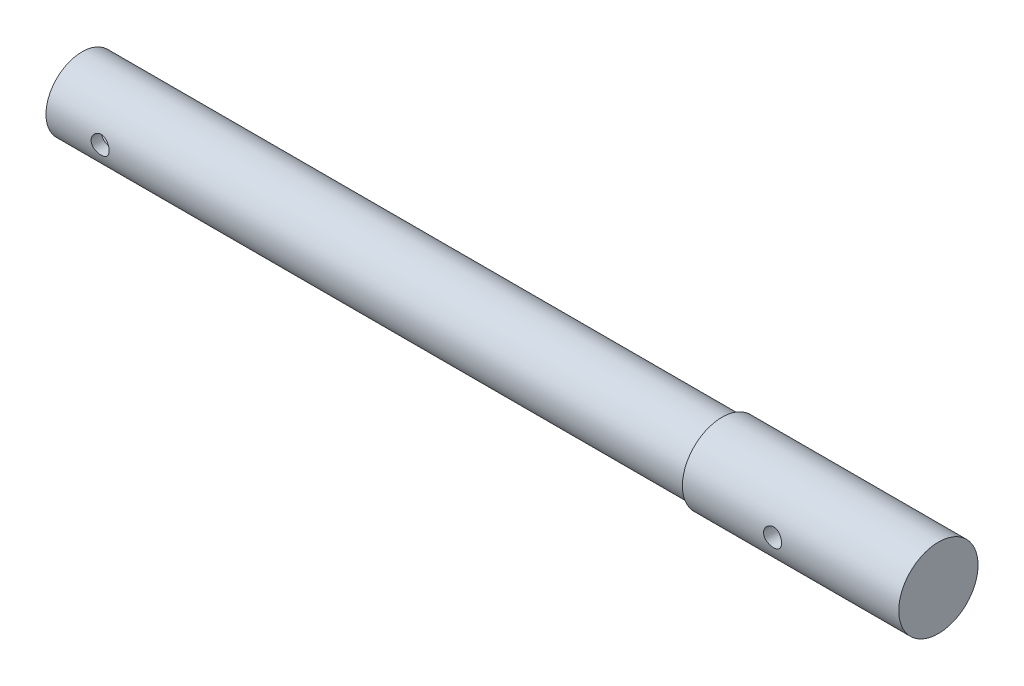
ISO-10303-21;
HEADER;
FILE_DESCRIPTION(('STEP AP214'),'2;1');
FILE_NAME('part.step','',(''),(''),'','','');
FILE_SCHEMA(('AUTOMOTIVE_DESIGN { 1 0 10303 214 1 1 1 1 }'));
ENDSEC;
DATA;
#1=APPLICATION_CONTEXT('core data for automotive mechanical design processes');
#2=APPLICATION_PROTOCOL_DEFINITION('international standard','automotive_design',2000,#1);
#3=PRODUCT_CONTEXT('',#1,'mechanical');
#4=PRODUCT('Part','Part','',(#3));
#5=PRODUCT_RELATED_PRODUCT_CATEGORY('part','',(#4));
#6=PRODUCT_DEFINITION_FORMATION('','',#4);
#7=PRODUCT_DEFINITION_CONTEXT('part definition',#1,'design');
#8=PRODUCT_DEFINITION('design','',#6,#7);
#9=PRODUCT_DEFINITION_SHAPE('','',#8);
#10=(LENGTH_UNIT() NAMED_UNIT(*) SI_UNIT(.MILLI.,.METRE.));
#11=(NAMED_UNIT(*) PLANE_ANGLE_UNIT() SI_UNIT($,.RADIAN.));
#12=(NAMED_UNIT(*) SI_UNIT($,.STERADIAN.) SOLID_ANGLE_UNIT());
#13=UNCERTAINTY_MEASURE_WITH_UNIT(LENGTH_MEASURE(1.E-05),#10,'distance_accuracy_value','');
#14=(GEOMETRIC_REPRESENTATION_CONTEXT(3) GLOBAL_UNCERTAINTY_ASSIGNED_CONTEXT((#13)) GLOBAL_UNIT_ASSIGNED_CONTEXT((#10,
#11,#12)) REPRESENTATION_CONTEXT('',''));
#15=CARTESIAN_POINT('',(0.,0.,0.));
#16=DIRECTION('',(0.,0.,1.));
#17=DIRECTION('',(1.,0.,0.));
#18=AXIS2_PLACEMENT_3D('',#15,#16,#17);
#19=CARTESIAN_POINT('',(0.,0.,0.));
#20=DIRECTION('',(-1.,0.,0.));
#21=DIRECTION('',(0.,0.,1.));
#22=AXIS2_PLACEMENT_3D('',#19,#20,#21);
#23=PLANE('',#22);
#24=CARTESIAN_POINT('',(0.,0.,0.));
#25=DIRECTION('',(-1.,0.,0.));
#26=DIRECTION('',(0.,0.,1.));
#27=AXIS2_PLACEMENT_3D('',#24,#25,#26);
#28=CIRCLE('',#27,11.);
#29=CARTESIAN_POINT('',(0.,0.,11.));
#30=VERTEX_POINT('',#29);
#31=EDGE_CURVE('E50',#30,#30,#28,.T.);
#32=ORIENTED_EDGE('',*,*,#31,.F.);
#33=EDGE_LOOP('',(#32));
#34=FACE_BOUND('',#33,.T.);
#35=ADVANCED_FACE('F34',(#34),#23,.F.);
#36=CARTESIAN_POINT('',(-237.5,0.,0.));
#37=DIRECTION('',(-1.,0.,0.));
#38=DIRECTION('',(0.,0.,1.));
#39=AXIS2_PLACEMENT_3D('',#36,#37,#38);
#40=CYLINDRICAL_SURFACE('',#39,11.);
#41=CARTESIAN_POINT('',(-32.5,0.,-11.));
#42=CARTESIAN_POINT('',(-32.5000045318264,0.138518278596931,-10.9999974735185));
#43=CARTESIAN_POINT('',(-32.5115512275769,0.277090172258033,-10.9973570934613));
#44=CARTESIAN_POINT('',(-32.5573794760617,0.550288594599343,-10.987079320306));
#45=CARTESIAN_POINT('',(-32.5916763959553,0.684912392220746,-10.9794385496265));
#46=CARTESIAN_POINT('',(-32.6818680486319,0.94622767198493,-10.9600095312294));
#47=CARTESIAN_POINT('',(-32.7377393279807,1.07292759495649,-10.9482257885674));
#48=CARTESIAN_POINT('',(-32.8694171133808,1.31515227582567,-10.921778201627));
#49=CARTESIAN_POINT('',(-32.9452234208424,1.43067714503183,-10.9071143860399));
#50=CARTESIAN_POINT('',(-33.1160020446066,1.64926760444639,-10.8762265816814));
#51=CARTESIAN_POINT('',(-33.211252573475,1.7521129389205,-10.8599819758326));
#52=CARTESIAN_POINT('',(-33.4176189741372,1.94051389816611,-10.827906511833));
#53=CARTESIAN_POINT('',(-33.5287363506944,2.02606788121784,-10.8120756930933));
#54=CARTESIAN_POINT('',(-33.7653320552837,2.17844599401787,-10.7824158369221));
#55=CARTESIAN_POINT('',(-33.8909669963058,2.24503254356577,-10.7686131580577));
#56=CARTESIAN_POINT('',(-34.1520095005816,2.35606069717871,-10.7448696147508));
#57=CARTESIAN_POINT('',(-34.2874157920616,2.40050517717749,-10.7349282488168));
#58=CARTESIAN_POINT('',(-34.5617591871165,2.46525349412718,-10.7202434469831));
#59=CARTESIAN_POINT('',(-34.7005992631225,2.48594892680755,-10.715415797339));
#60=CARTESIAN_POINT('',(-34.9798582272131,2.50382988451489,-10.7112523406768));
#61=CARTESIAN_POINT('',(-35.1202769026623,2.50101853886554,-10.711915802658));
#62=CARTESIAN_POINT('',(-35.3957728833487,2.47228016958763,-10.7185835035919));
#63=CARTESIAN_POINT('',(-35.5309009061949,2.44681104599439,-10.7244819412976));
#64=CARTESIAN_POINT('',(-35.7949144861548,2.37420684920503,-10.7407873672743));
#65=CARTESIAN_POINT('',(-35.9237996676272,2.32707047404289,-10.7511946264744));
#66=CARTESIAN_POINT('',(-36.1729406718105,2.21205734402545,-10.7754474384537));
#67=CARTESIAN_POINT('',(-36.2931135177637,2.14400712086008,-10.7893215597825));
#68=CARTESIAN_POINT('',(-36.5205025531111,1.98921977920408,-10.8189276843241));
#69=CARTESIAN_POINT('',(-36.6277168402639,1.90247992237134,-10.8346599596346));
#70=CARTESIAN_POINT('',(-36.828778561821,1.71036518003516,-10.866661528725));
#71=CARTESIAN_POINT('',(-36.9222544265163,1.60460166742827,-10.882934773515));
#72=CARTESIAN_POINT('',(-37.0902058887071,1.37871229840972,-10.9138502597158));
#73=CARTESIAN_POINT('',(-37.1646810866995,1.2585861400908,-10.9284924668293));
#74=CARTESIAN_POINT('',(-37.2926203879715,1.00690799179916,-10.9545497424637));
#75=CARTESIAN_POINT('',(-37.3460327736223,0.875328834348156,-10.9659568484873));
#76=CARTESIAN_POINT('',(-37.4298840058679,0.604745122491696,-10.9841998956698));
#77=CARTESIAN_POINT('',(-37.4603264658222,0.465741739663721,-10.9910365557784));
#78=CARTESIAN_POINT('',(-37.4968262374727,0.187439840192737,-10.9992650071756));
#79=CARTESIAN_POINT('',(-37.5033906913167,0.0482110923370425,-11.0007700184113));
#80=CARTESIAN_POINT('',(-37.4933269601471,-0.2293538866801,-10.9984842255063));
#81=CARTESIAN_POINT('',(-37.476700480594,-0.367690182720856,-10.9946938107912));
#82=CARTESIAN_POINT('',(-37.4211468330946,-0.637841677218453,-10.9823148103741));
#83=CARTESIAN_POINT('',(-37.3824884535563,-0.769715036814416,-10.973784087055));
#84=CARTESIAN_POINT('',(-37.2842689725429,-1.02510393087759,-10.9528806132367));
#85=CARTESIAN_POINT('',(-37.2247059957467,-1.14861871432288,-10.9405075180554));
#86=CARTESIAN_POINT('',(-37.0853308564446,-1.38586085256055,-10.9130143275095));
#87=CARTESIAN_POINT('',(-37.0052243732268,-1.49941068522718,-10.8978552985532));
#88=CARTESIAN_POINT('',(-36.8274206715598,-1.71163773579051,-10.866546095646));
#89=CARTESIAN_POINT('',(-36.7297209734532,-1.8103128535797,-10.8503957821912));
#90=CARTESIAN_POINT('',(-36.5171690348666,-1.99201706218096,-10.8185287714487));
#91=CARTESIAN_POINT('',(-36.4020127582132,-2.0746936659406,-10.8028272119253));
#92=CARTESIAN_POINT('',(-36.1591536093297,-2.21953814406551,-10.7740023321604));
#93=CARTESIAN_POINT('',(-36.0314512920404,-2.28170692501017,-10.7608788979592));
#94=CARTESIAN_POINT('',(-35.7678195304311,-2.38333597241928,-10.7388274870674));
#95=CARTESIAN_POINT('',(-35.6319426762566,-2.42292716221703,-10.7298753781702));
#96=CARTESIAN_POINT('',(-35.3552330933009,-2.47865258340363,-10.7171411058581));
#97=CARTESIAN_POINT('',(-35.2144012348636,-2.49479091341614,-10.7133580391079));
#98=CARTESIAN_POINT('',(-34.9353413806891,-2.50296739214164,-10.7114502943222));
#99=CARTESIAN_POINT('',(-34.7971304006664,-2.49556548501069,-10.7131941458177));
#100=CARTESIAN_POINT('',(-34.5239810898117,-2.45813115403282,-10.7218446846914));
#101=CARTESIAN_POINT('',(-34.3890427138895,-2.42809904217009,-10.7287513008948));
#102=CARTESIAN_POINT('',(-34.1267566026337,-2.34653692360609,-10.7468826027048));
#103=CARTESIAN_POINT('',(-33.9993803088585,-2.29509457527994,-10.758089666867));
#104=CARTESIAN_POINT('',(-33.7549852930994,-2.17224536606879,-10.783564723281));
#105=CARTESIAN_POINT('',(-33.6379677496745,-2.10083623731222,-10.7978330631966));
#106=CARTESIAN_POINT('',(-33.4148655723447,-1.93824996891049,-10.828211072634));
#107=CARTESIAN_POINT('',(-33.3090742777926,-1.84667645642834,-10.8443540558786));
#108=CARTESIAN_POINT('',(-33.114176814918,-1.64715628932417,-10.8764454859305));
#109=CARTESIAN_POINT('',(-33.025074529034,-1.53920583540676,-10.8923938866665));
#110=CARTESIAN_POINT('',(-32.8648619397663,-1.30814060515057,-10.9225693389041));
#111=CARTESIAN_POINT('',(-32.7940261766668,-1.18483162187621,-10.9367686161711));
#112=CARTESIAN_POINT('',(-32.674200029337,-0.927755967711694,-10.9615640551399));
#113=CARTESIAN_POINT('',(-32.6251920052134,-0.793997844337688,-10.9721631246672));
#114=CARTESIAN_POINT('',(-32.5587720938239,-0.550163071539607,-10.9867559512784));
#115=CARTESIAN_POINT('',(-32.5367760123107,-0.441368111138475,-10.9916908558499));
#116=CARTESIAN_POINT('',(-32.5073885264206,-0.221726814930898,-10.9983138080737));
#117=CARTESIAN_POINT('',(-32.4999963723808,-0.110880584717078,-11.0000020223883));
#118=CARTESIAN_POINT('',(-32.5,0.,-11.));
#119=B_SPLINE_CURVE_WITH_KNOTS('',3,(#41,#42,#43,#44,#45,#46,#47,#48,#49,#50,#51,#52,#53,#54,
#55,#56,#57,#58,#59,#60,#61,#62,#63,#64,#65,#66,#67,#68,#69,#70,#71,#72,#73,#74,#75,#76,#77,#78,
#79,#80,#81,#82,#83,#84,#85,#86,#87,#88,#89,#90,#91,#92,#93,#94,#95,#96,#97,#98,#99,#100,#101,
#102,#103,#104,#105,#106,#107,#108,#109,#110,#111,#112,#113,#114,#115,#116,#117,#118),
.UNSPECIFIED.,.T.,.F.,(4,2,2,2,2,2,2,2,2,2,2,2,2,2,2,2,2,2,2,2,2,2,2,2,2,2,2,2,2,2,2,2,2,2,2,2,
2,2,4),(0.,0.415148849633309,0.830578406996924,1.24555761755317,1.66053269430522,
2.08192389396806,2.50335508365801,2.92985362973412,3.35629676538236,3.77560244898081,
4.19485231368759,4.60581714174236,5.01680666753972,5.4313015743885,5.84585725297977,
6.27011531803704,6.69438230269863,7.11968464096648,7.54492006169895,7.96106941916762,
8.37718817463626,8.78833576149035,9.19952024123084,9.61696129328767,10.0344612272567,
10.4603132154039,10.8861463755948,11.3094844190899,11.732748471094,12.1460204395145,
12.5592867105954,12.9708773657615,13.382514789318,13.8031102578591,14.2238034502007,
14.6504927745346,15.0768366452215,15.4091704772436,15.74148724914),.UNSPECIFIED.);
#120=CARTESIAN_POINT('',(-32.5,0.,-11.));
#121=VERTEX_POINT('',#120);
#122=EDGE_CURVE('E10',#121,#121,#119,.T.);
#123=ORIENTED_EDGE('',*,*,#122,.T.);
#124=EDGE_LOOP('',(#123));
#125=FACE_BOUND('',#124,.T.);
#126=CARTESIAN_POINT('',(-32.5,0.,11.));
#127=CARTESIAN_POINT('',(-32.5000045318264,-0.138518278596891,10.9999974735185));
#128=CARTESIAN_POINT('',(-32.5115512275769,-0.277090172257995,10.9973570934613));
#129=CARTESIAN_POINT('',(-32.5573794760617,-0.55028859459931,10.987079320306));
#130=CARTESIAN_POINT('',(-32.5916763959553,-0.684912392220716,10.9794385496265));
#131=CARTESIAN_POINT('',(-32.6818680486319,-0.946227671984906,10.9600095312294));
#132=CARTESIAN_POINT('',(-32.7377393279807,-1.07292759495647,10.9482257885674));
#133=CARTESIAN_POINT('',(-32.8694171133808,-1.31515227582566,10.921778201627));
#134=CARTESIAN_POINT('',(-32.9452234208424,-1.43067714503183,10.9071143860399));
#135=CARTESIAN_POINT('',(-33.1160020446066,-1.64926760444638,10.8762265816814));
#136=CARTESIAN_POINT('',(-33.211252573475,-1.75211293892048,10.8599819758326));
#137=CARTESIAN_POINT('',(-33.4176189741372,-1.94051389816609,10.827906511833));
#138=CARTESIAN_POINT('',(-33.5287363506944,-2.02606788121783,10.8120756930933));
#139=CARTESIAN_POINT('',(-33.7653320552837,-2.17844599401786,10.7824158369221));
#140=CARTESIAN_POINT('',(-33.8909669963058,-2.24503254356574,10.7686131580577));
#141=CARTESIAN_POINT('',(-34.1520095005816,-2.35606069717869,10.7448696147509));
#142=CARTESIAN_POINT('',(-34.2874157920616,-2.40050517717749,10.7349282488168));
#143=CARTESIAN_POINT('',(-34.5617591871165,-2.46525349412718,10.7202434469831));
#144=CARTESIAN_POINT('',(-34.7005992631225,-2.48594892680753,10.715415797339));
#145=CARTESIAN_POINT('',(-34.9798582272131,-2.50382988451486,10.7112523406768));
#146=CARTESIAN_POINT('',(-35.1202769026623,-2.50101853886553,10.711915802658));
#147=CARTESIAN_POINT('',(-35.3957728833487,-2.47228016958762,10.7185835035919));
#148=CARTESIAN_POINT('',(-35.5309009061949,-2.44681104599436,10.7244819412976));
#149=CARTESIAN_POINT('',(-35.7949144861548,-2.374206849205,10.7407873672743));
#150=CARTESIAN_POINT('',(-35.9237996676272,-2.32707047404288,10.7511946264744));
#151=CARTESIAN_POINT('',(-36.1729406718105,-2.21205734402543,10.7754474384537));
#152=CARTESIAN_POINT('',(-36.2931135177637,-2.14400712086006,10.7893215597825));
#153=CARTESIAN_POINT('',(-36.520502553111,-1.98921977920407,10.8189276843241));
#154=CARTESIAN_POINT('',(-36.6277168402639,-1.90247992237134,10.8346599596346));
#155=CARTESIAN_POINT('',(-36.828778561821,-1.71036518003517,10.8666615287251));
#156=CARTESIAN_POINT('',(-36.9222544265163,-1.60460166742826,10.882934773515));
#157=CARTESIAN_POINT('',(-37.0902058887071,-1.37871229840971,10.9138502597158));
#158=CARTESIAN_POINT('',(-37.1646810866995,-1.2585861400908,10.9284924668293));
#159=CARTESIAN_POINT('',(-37.2926203879715,-1.00690799179915,10.9545497424638));
#160=CARTESIAN_POINT('',(-37.3460327736223,-0.87532883434815,10.9659568484874));
#161=CARTESIAN_POINT('',(-37.4298840058679,-0.604745122491694,10.9841998956698));
#162=CARTESIAN_POINT('',(-37.4603264658222,-0.465741739663724,10.9910365557784));
#163=CARTESIAN_POINT('',(-37.4968262374727,-0.187439840192742,10.9992650071756));
#164=CARTESIAN_POINT('',(-37.5033906913167,-0.0482110923370446,11.0007700184113));
#165=CARTESIAN_POINT('',(-37.4933269601471,0.229353886680103,10.9984842255063));
#166=CARTESIAN_POINT('',(-37.476700480594,0.36769018272086,10.9946938107912));
#167=CARTESIAN_POINT('',(-37.4211468330946,0.637841677218461,10.9823148103741));
#168=CARTESIAN_POINT('',(-37.3824884535563,0.769715036814426,10.973784087055));
#169=CARTESIAN_POINT('',(-37.2842689725429,1.0251039308776,10.9528806132367));
#170=CARTESIAN_POINT('',(-37.2247059957467,1.14861871432289,10.9405075180554));
#171=CARTESIAN_POINT('',(-37.0853308564446,1.38586085256056,10.9130143275095));
#172=CARTESIAN_POINT('',(-37.0052243732268,1.49941068522719,10.8978552985532));
#173=CARTESIAN_POINT('',(-36.8274206715598,1.71163773579053,10.866546095646));
#174=CARTESIAN_POINT('',(-36.7297209734532,1.81031285357971,10.8503957821913));
#175=CARTESIAN_POINT('',(-36.5171690348666,1.99201706218097,10.8185287714487));
#176=CARTESIAN_POINT('',(-36.4020127582132,2.07469366594063,10.8028272119253));
#177=CARTESIAN_POINT('',(-36.1591536093297,2.21953814406552,10.7740023321604));
#178=CARTESIAN_POINT('',(-36.0314512920404,2.28170692501017,10.7608788979592));
#179=CARTESIAN_POINT('',(-35.7678195304311,2.38333597241928,10.7388274870674));
#180=CARTESIAN_POINT('',(-35.6319426762566,2.42292716221705,10.7298753781702));
#181=CARTESIAN_POINT('',(-35.3552330933009,2.47865258340366,10.7171411058581));
#182=CARTESIAN_POINT('',(-35.2144012348636,2.49479091341614,10.7133580391079));
#183=CARTESIAN_POINT('',(-34.9353413806891,2.50296739214165,10.7114502943222));
#184=CARTESIAN_POINT('',(-34.7971304006664,2.49556548501072,10.7131941458177));
#185=CARTESIAN_POINT('',(-34.5239810898117,2.45813115403284,10.7218446846914));
#186=CARTESIAN_POINT('',(-34.3890427138895,2.42809904217009,10.7287513008948));
#187=CARTESIAN_POINT('',(-34.1267566026337,2.34653692360609,10.7468826027048));
#188=CARTESIAN_POINT('',(-33.9993803088585,2.29509457527996,10.758089666867));
#189=CARTESIAN_POINT('',(-33.7549852930994,2.17224536606882,10.7835647232811));
#190=CARTESIAN_POINT('',(-33.6379677496745,2.10083623731225,10.7978330631966));
#191=CARTESIAN_POINT('',(-33.4148655723447,1.93824996891051,10.8282110726341));
#192=CARTESIAN_POINT('',(-33.3090742777926,1.84667645642836,10.8443540558786));
#193=CARTESIAN_POINT('',(-33.114176814918,1.64715628932419,10.8764454859305));
#194=CARTESIAN_POINT('',(-33.025074529034,1.53920583540677,10.8923938866665));
#195=CARTESIAN_POINT('',(-32.8648619397663,1.30814060515058,10.9225693389041));
#196=CARTESIAN_POINT('',(-32.7940261766668,1.18483162187622,10.9367686161711));
#197=CARTESIAN_POINT('',(-32.674200029337,0.927755967711713,10.9615640551399));
#198=CARTESIAN_POINT('',(-32.6251920052133,0.793997844337707,10.9721631246672));
#199=CARTESIAN_POINT('',(-32.5587720938239,0.550163071539631,10.9867559512784));
#200=CARTESIAN_POINT('',(-32.5367760123107,0.441368111138502,10.9916908558499));
#201=CARTESIAN_POINT('',(-32.5073885264206,0.221726814930933,10.9983138080738));
#202=CARTESIAN_POINT('',(-32.4999963723808,0.110880584717116,11.0000020223883));
#203=CARTESIAN_POINT('',(-32.5,0.,11.));
#204=B_SPLINE_CURVE_WITH_KNOTS('',3,(#126,#127,#128,#129,#130,#131,#132,#133,#134,#135,#136,
#137,#138,#139,#140,#141,#142,#143,#144,#145,#146,#147,#148,#149,#150,#151,#152,#153,#154,#155,
#156,#157,#158,#159,#160,#161,#162,#163,#164,#165,#166,#167,#168,#169,#170,#171,#172,#173,#174,
#175,#176,#177,#178,#179,#180,#181,#182,#183,#184,#185,#186,#187,#188,#189,#190,#191,#192,#193,
#194,#195,#196,#197,#198,#199,#200,#201,#202,#203),.UNSPECIFIED.,.T.,.F.,(4,2,2,2,2,2,2,2,2,2,2,
2,2,2,2,2,2,2,2,2,2,2,2,2,2,2,2,2,2,2,2,2,2,2,2,2,2,2,4),(0.,0.415148849633315,
0.830578406996938,1.2455576175532,1.66053269430526,2.08192389396809,2.50335508365803,
2.92985362973415,3.35629676538239,3.77560244898084,4.19485231368761,4.60581714174238,
5.01680666753974,5.43130157438851,5.84585725297978,6.27011531803705,6.69438230269865,
7.11968464096648,7.54492006169895,7.96106941916762,8.37718817463628,8.78833576149037,
9.19952024123085,9.61696129328768,10.0344612272567,10.460313215404,10.8861463755948,
11.3094844190899,11.732748471094,12.1460204395145,12.5592867105954,12.9708773657615,
13.382514789318,13.8031102578591,14.2238034502007,14.6504927745347,15.0768366452216,
15.4091704772436,15.74148724914),.UNSPECIFIED.);
#205=CARTESIAN_POINT('',(-32.5,0.,11.));
#206=VERTEX_POINT('',#205);
#207=EDGE_CURVE('E45',#206,#206,#204,.T.);
#208=ORIENTED_EDGE('',*,*,#207,.T.);
#209=EDGE_LOOP('',(#208));
#210=FACE_BOUND('',#209,.T.);
#211=CARTESIAN_POINT('',(-60.,0.,0.));
#212=DIRECTION('',(-1.,0.,0.));
#213=DIRECTION('',(0.,0.,1.));
#214=AXIS2_PLACEMENT_3D('',#211,#212,#213);
#215=CIRCLE('',#214,11.);
#216=CARTESIAN_POINT('',(-60.,0.,11.));
#217=VERTEX_POINT('',#216);
#218=EDGE_CURVE('E122',#217,#217,#215,.T.);
#219=ORIENTED_EDGE('',*,*,#218,.F.);
#220=EDGE_LOOP('',(#219));
#221=FACE_BOUND('',#220,.T.);
#222=ORIENTED_EDGE('',*,*,#31,.T.);
#223=EDGE_LOOP('',(#222));
#224=FACE_BOUND('',#223,.T.);
#225=ADVANCED_FACE('F61',(#125,#210,#221,#224),#40,.T.);
#226=CARTESIAN_POINT('',(-60.,11.,0.));
#227=DIRECTION('',(1.,0.,0.));
#228=DIRECTION('',(0.,0.,-1.));
#229=AXIS2_PLACEMENT_3D('',#226,#227,#228);
#230=PLANE('',#229);
#231=CARTESIAN_POINT('',(-60.,0.,0.));
#232=DIRECTION('',(-1.,0.,0.));
#233=DIRECTION('',(0.,0.,1.));
#234=AXIS2_PLACEMENT_3D('',#231,#232,#233);
#235=CIRCLE('',#234,10.);
#236=CARTESIAN_POINT('',(-60.,0.,10.));
#237=VERTEX_POINT('',#236);
#238=EDGE_CURVE('E124',#237,#237,#235,.T.);
#239=ORIENTED_EDGE('',*,*,#238,.F.);
#240=EDGE_LOOP('',(#239));
#241=FACE_BOUND('',#240,.T.);
#242=ORIENTED_EDGE('',*,*,#218,.T.);
#243=EDGE_LOOP('',(#242));
#244=FACE_BOUND('',#243,.T.);
#245=ADVANCED_FACE('F80',(#241,#244),#230,.F.);
#246=CARTESIAN_POINT('',(-237.5,0.,0.));
#247=DIRECTION('',(-1.,0.,0.));
#248=DIRECTION('',(0.,0.,1.));
#249=AXIS2_PLACEMENT_3D('',#246,#247,#248);
#250=CYLINDRICAL_SURFACE('',#249,9.99999999999999);
#251=CARTESIAN_POINT('',(-220.,0.,9.99999999999999));
#252=CARTESIAN_POINT('',(-220.00000387623,-0.138126814449563,9.99999766446686));
#253=CARTESIAN_POINT('',(-220.011485917956,-0.276296929717958,9.99710963553044));
#254=CARTESIAN_POINT('',(-220.057041918845,-0.548677206284231,9.98586856383157));
#255=CARTESIAN_POINT('',(-220.091128682563,-0.682885078117891,9.97751242366625));
#256=CARTESIAN_POINT('',(-220.180732089103,-0.94336812030431,9.95626043886718));
#257=CARTESIAN_POINT('',(-220.236222997859,-1.06965260571673,9.94337004736762));
#258=CARTESIAN_POINT('',(-220.366968983408,-1.31112021984076,9.91442239679368));
#259=CARTESIAN_POINT('',(-220.442224726865,-1.4263029739146,9.8983650309026));
#260=CARTESIAN_POINT('',(-220.61200131609,-1.64466987883487,9.86445689319488));
#261=CARTESIAN_POINT('',(-220.706852624932,-1.74759281676851,9.84657845246875));
#262=CARTESIAN_POINT('',(-220.912420341515,-1.93624821200563,9.81122700196558));
#263=CARTESIAN_POINT('',(-221.023138538245,-2.02197872824868,9.79375403816444));
#264=CARTESIAN_POINT('',(-221.259325377895,-2.17504423799829,9.7609129283028));
#265=CARTESIAN_POINT('',(-221.384988718014,-2.24208702654194,9.74557990774683));
#266=CARTESIAN_POINT('',(-221.646247352767,-2.35399484758463,9.71915824696692));
#267=CARTESIAN_POINT('',(-221.781841055553,-2.3988634257336,9.70806892824029));
#268=CARTESIAN_POINT('',(-222.056239163669,-2.46425806134129,9.69167461160537));
#269=CARTESIAN_POINT('',(-222.19492482673,-2.48525378055344,9.68625818328351));
#270=CARTESIAN_POINT('',(-222.473947614999,-2.50376962511071,9.68148937432651));
#271=CARTESIAN_POINT('',(-222.61428446782,-2.50129356969689,9.68213600713212));
#272=CARTESIAN_POINT('',(-222.889026346242,-2.47331087439951,9.68932009194694));
#273=CARTESIAN_POINT('',(-223.023492702442,-2.44836390031768,9.69571438345489));
#274=CARTESIAN_POINT('',(-223.286268418185,-2.37704031150496,9.71344516118448));
#275=CARTESIAN_POINT('',(-223.414577338381,-2.33066217011568,9.7247819994873));
#276=CARTESIAN_POINT('',(-223.662896693753,-2.21731579656198,9.75125189842764));
#277=CARTESIAN_POINT('',(-223.782810286316,-2.15014444538813,9.76642212449694));
#278=CARTESIAN_POINT('',(-224.009864516261,-1.99726046002484,9.79882851409986));
#279=CARTESIAN_POINT('',(-224.117002913445,-1.91154458134807,9.81606503891047));
#280=CARTESIAN_POINT('',(-224.318672692824,-1.72110570780205,9.85126467566485));
#281=CARTESIAN_POINT('',(-224.412757483435,-1.61591043027637,9.86923449130002));
#282=CARTESIAN_POINT('',(-224.582035404106,-1.39101986250609,9.90343275964594));
#283=CARTESIAN_POINT('',(-224.657227957106,-1.27132412951323,9.91966115915679));
#284=CARTESIAN_POINT('',(-224.786750977041,-1.02019314780232,9.9486288682365));
#285=CARTESIAN_POINT('',(-224.841008900424,-0.888718988680973,9.96135600212879));
#286=CARTESIAN_POINT('',(-224.926528842849,-0.618126680238056,9.98179861652361));
#287=CARTESIAN_POINT('',(-224.957795260697,-0.479009998584106,9.98951505565468));
#288=CARTESIAN_POINT('',(-224.995762609265,-0.200899950650047,9.99892498785624));
#289=CARTESIAN_POINT('',(-225.003071710125,-0.0619945333136788,10.0007675584713));
#290=CARTESIAN_POINT('',(-224.994584996574,0.21505479133586,9.99864674690753));
#291=CARTESIAN_POINT('',(-224.978791262001,0.353198766074341,9.9946838873642));
#292=CARTESIAN_POINT('',(-224.925048486014,0.622690447960814,9.98149301878917));
#293=CARTESIAN_POINT('',(-224.887431227538,0.754108531614561,9.97234390309647));
#294=CARTESIAN_POINT('',(-224.791488193286,1.00876215408751,9.94981177723595));
#295=CARTESIAN_POINT('',(-224.733160326144,1.13199686505443,9.93642833949964));
#296=CARTESIAN_POINT('',(-224.596273118542,1.36920522404974,9.90655513210369));
#297=CARTESIAN_POINT('',(-224.517373146005,1.48297573639294,9.89001445610999));
#298=CARTESIAN_POINT('',(-224.342016818671,1.69587768940551,9.85574181979587));
#299=CARTESIAN_POINT('',(-224.24555743397,1.79500659828876,9.83800965421577));
#300=CARTESIAN_POINT('',(-224.034996731927,1.97831761345416,9.80281594932497));
#301=CARTESIAN_POINT('',(-223.920520495001,2.06207311270184,9.78537173637464));
#302=CARTESIAN_POINT('',(-223.678778942552,2.20918459835604,9.75321463970069));
#303=CARTESIAN_POINT('',(-223.551514195049,2.27254149026903,9.7385016347494));
#304=CARTESIAN_POINT('',(-223.288490462656,2.37658570101226,9.71363491194664));
#305=CARTESIAN_POINT('',(-223.152787286146,2.41740732773932,9.70345425375809));
#306=CARTESIAN_POINT('',(-222.876150603574,2.47557609990489,9.68877906706586));
#307=CARTESIAN_POINT('',(-222.735218248298,2.49292837912653,9.68428329504043));
#308=CARTESIAN_POINT('',(-222.456464960231,2.50339765056087,9.6815816870161));
#309=CARTESIAN_POINT('',(-222.318670941456,2.49719649630137,9.68319887888033));
#310=CARTESIAN_POINT('',(-222.046160185556,2.4622954638537,9.69213181672142));
#311=CARTESIAN_POINT('',(-221.911443386644,2.43359603781101,9.6994474481773));
#312=CARTESIAN_POINT('',(-221.649652568223,2.35488553240497,9.7188543447322));
#313=CARTESIAN_POINT('',(-221.522537824599,2.30500234113408,9.73091692061056));
#314=CARTESIAN_POINT('',(-221.27839102881,2.18544152267507,9.75846259540839));
#315=CARTESIAN_POINT('',(-221.161360378022,2.11576115005697,9.77394616867807));
#316=CARTESIAN_POINT('',(-220.937408951663,1.9564462477286,9.80709390439337));
#317=CARTESIAN_POINT('',(-220.830831544293,1.86633860485383,9.82480441386301));
#318=CARTESIAN_POINT('',(-220.634088258674,1.66964895198295,9.86013378743768));
#319=CARTESIAN_POINT('',(-220.543926283145,1.56306303543526,9.8777526287842));
#320=CARTESIAN_POINT('',(-220.380981152392,1.33411264450434,9.91129426079448));
#321=CARTESIAN_POINT('',(-220.308542310547,1.21149737052739,9.92718055609782));
#322=CARTESIAN_POINT('',(-220.185420895099,0.955443432517535,9.9550820829186));
#323=CARTESIAN_POINT('',(-220.134722732252,0.822012605727921,9.967100086663));
#324=CARTESIAN_POINT('',(-220.06404694945,0.574017088739122,9.98413432609235));
#325=CARTESIAN_POINT('',(-220.040081261577,0.460633618180135,9.99004308421151));
#326=CARTESIAN_POINT('',(-220.00805676063,0.231510119227165,9.9979767538658));
#327=CARTESIAN_POINT('',(-219.999996751158,0.115770268737706,10.0000019575149));
#328=CARTESIAN_POINT('',(-220.,0.,9.99999999999999));
#329=B_SPLINE_CURVE_WITH_KNOTS('',3,(#251,#252,#253,#254,#255,#256,#257,#258,#259,#260,#261,
#262,#263,#264,#265,#266,#267,#268,#269,#270,#271,#272,#273,#274,#275,#276,#277,#278,#279,#280,
#281,#282,#283,#284,#285,#286,#287,#288,#289,#290,#291,#292,#293,#294,#295,#296,#297,#298,#299,
#300,#301,#302,#303,#304,#305,#306,#307,#308,#309,#310,#311,#312,#313,#314,#315,#316,#317,#318,
#319,#320,#321,#322,#323,#324,#325,#326,#327,#328),.UNSPECIFIED.,.T.,.F.,(4,2,2,2,2,2,2,2,2,2,2,
2,2,2,2,2,2,2,2,2,2,2,2,2,2,2,2,2,2,2,2,2,2,2,2,2,2,2,4),(0.,0.413956187453158,
0.828147062939855,1.24184150381021,1.65554990028229,2.07690725728573,2.49831215966778,
2.92597745909684,3.35357435282285,3.77260491835128,4.19156730193381,4.60037495017246,
5.00921172448945,5.42217546462014,5.83521151399152,6.26002501620577,6.68485149269294,
7.11113715020737,7.53734122819951,7.95263848254338,8.36789835193448,8.77700457528938,
9.18615212209362,9.60255979281132,10.0190393835224,10.44574182013,10.8724253125472,
11.2965375769764,11.7205570543047,12.1323963400749,12.5442273493654,12.9536066760889,
13.3630428023798,13.7831596069299,14.2033761629384,14.6312030917579,15.0587227304539,
15.4057040491339,15.7526592674821),.UNSPECIFIED.);
#330=CARTESIAN_POINT('',(-220.,0.,9.99999999999999));
#331=VERTEX_POINT('',#330);
#332=EDGE_CURVE('E88',#331,#331,#329,.T.);
#333=ORIENTED_EDGE('',*,*,#332,.T.);
#334=EDGE_LOOP('',(#333));
#335=FACE_BOUND('',#334,.T.);
#336=CARTESIAN_POINT('',(-220.,0.,-9.99999999999999));
#337=CARTESIAN_POINT('',(-220.00000387623,0.138126814449559,-9.99999766446687));
#338=CARTESIAN_POINT('',(-220.011485917956,0.276296929717945,-9.99710963553042));
#339=CARTESIAN_POINT('',(-220.057041918845,0.548677206284231,-9.98586856383155));
#340=CARTESIAN_POINT('',(-220.091128682563,0.682885078117913,-9.97751242366625));
#341=CARTESIAN_POINT('',(-220.180732089103,0.94336812030431,-9.9562604388672));
#342=CARTESIAN_POINT('',(-220.236222997859,1.06965260571668,-9.94337004736763));
#343=CARTESIAN_POINT('',(-220.366968983408,1.31112021984073,-9.91442239679367));
#344=CARTESIAN_POINT('',(-220.442224726865,1.42630297391462,-9.89836503090257));
#345=CARTESIAN_POINT('',(-220.61200131609,1.64466987883489,-9.86445689319486));
#346=CARTESIAN_POINT('',(-220.706852624932,1.74759281676846,-9.84657845246875));
#347=CARTESIAN_POINT('',(-220.912420341515,1.93624821200556,-9.81122700196559));
#348=CARTESIAN_POINT('',(-221.023138538245,2.02197872824868,-9.79375403816443));
#349=CARTESIAN_POINT('',(-221.259325377895,2.17504423799832,-9.76091292830277));
#350=CARTESIAN_POINT('',(-221.384988718014,2.24208702654194,-9.74557990774682));
#351=CARTESIAN_POINT('',(-221.646247352766,2.35399484758462,-9.71915824696692));
#352=CARTESIAN_POINT('',(-221.781841055553,2.39886342573362,-9.70806892824029));
#353=CARTESIAN_POINT('',(-222.056239163669,2.46425806134132,-9.69167461160536));
#354=CARTESIAN_POINT('',(-222.19492482673,2.48525378055346,-9.68625818328349));
#355=CARTESIAN_POINT('',(-222.473947614999,2.50376962511071,-9.68148937432651));
#356=CARTESIAN_POINT('',(-222.61428446782,2.50129356969689,-9.68213600713214));
#357=CARTESIAN_POINT('',(-222.889026346242,2.47331087439954,-9.68932009194695));
#358=CARTESIAN_POINT('',(-223.023492702442,2.44836390031775,-9.69571438345488));
#359=CARTESIAN_POINT('',(-223.286268418185,2.37704031150502,-9.71344516118446));
#360=CARTESIAN_POINT('',(-223.414577338381,2.33066217011569,-9.7247819994873));
#361=CARTESIAN_POINT('',(-223.662896693753,2.217315796562,-9.75125189842765));
#362=CARTESIAN_POINT('',(-223.782810286316,2.1501444453882,-9.76642212449692));
#363=CARTESIAN_POINT('',(-224.009864516261,1.99726046002491,-9.79882851409983));
#364=CARTESIAN_POINT('',(-224.117002913445,1.91154458134808,-9.81606503891045));
#365=CARTESIAN_POINT('',(-224.318672692824,1.72110570780206,-9.85126467566485));
#366=CARTESIAN_POINT('',(-224.412757483435,1.61591043027646,-9.86923449130001));
#367=CARTESIAN_POINT('',(-224.582035404106,1.39101986250617,-9.90343275964592));
#368=CARTESIAN_POINT('',(-224.657227957106,1.27132412951324,-9.91966115915676));
#369=CARTESIAN_POINT('',(-224.78675097704,1.02019314780232,-9.94862886823647));
#370=CARTESIAN_POINT('',(-224.841008900424,0.888718988681052,-9.96135600212876));
#371=CARTESIAN_POINT('',(-224.926528842849,0.618126680238154,-9.9817986165236));
#372=CARTESIAN_POINT('',(-224.957795260697,0.479009998584152,-9.98951505565467));
#373=CARTESIAN_POINT('',(-224.995762609264,0.200899950650052,-9.99892498785623));
#374=CARTESIAN_POINT('',(-225.003071710125,0.0619945333136912,-10.0007675584713));
#375=CARTESIAN_POINT('',(-224.994584996574,-0.215054791335836,-9.99864674690753));
#376=CARTESIAN_POINT('',(-224.978791262001,-0.353198766074313,-9.99468388736421));
#377=CARTESIAN_POINT('',(-224.925048486014,-0.622690447960812,-9.98149301878917));
#378=CARTESIAN_POINT('',(-224.887431227538,-0.754108531614588,-9.97234390309645));
#379=CARTESIAN_POINT('',(-224.791488193286,-1.00876215408753,-9.94981177723594));
#380=CARTESIAN_POINT('',(-224.733160326144,-1.13199686505442,-9.93642833949964));
#381=CARTESIAN_POINT('',(-224.596273118542,-1.36920522404973,-9.90655513210369));
#382=CARTESIAN_POINT('',(-224.517373146005,-1.48297573639297,-9.89001445610997));
#383=CARTESIAN_POINT('',(-224.342016818671,-1.69587768940555,-9.85574181979585));
#384=CARTESIAN_POINT('',(-224.24555743397,-1.79500659828876,-9.83800965421578));
#385=CARTESIAN_POINT('',(-224.034996731927,-1.97831761345415,-9.80281594932498));
#386=CARTESIAN_POINT('',(-223.920520495,-2.06207311270186,-9.78537173637461));
#387=CARTESIAN_POINT('',(-223.678778942552,-2.20918459835607,-9.75321463970066));
#388=CARTESIAN_POINT('',(-223.551514195049,-2.27254149026903,-9.73850163474939));
#389=CARTESIAN_POINT('',(-223.288490462656,-2.37658570101224,-9.71363491194664));
#390=CARTESIAN_POINT('',(-223.152787286146,-2.41740732773932,-9.70345425375807));
#391=CARTESIAN_POINT('',(-222.876150603574,-2.47557609990491,-9.68877906706582));
#392=CARTESIAN_POINT('',(-222.735218248297,-2.49292837912655,-9.68428329504041));
#393=CARTESIAN_POINT('',(-222.45646496023,-2.50339765056085,-9.68158168701609));
#394=CARTESIAN_POINT('',(-222.318670941456,-2.49719649630133,-9.68319887888032));
#395=CARTESIAN_POINT('',(-222.046160185556,-2.46229546385367,-9.69213181672141));
#396=CARTESIAN_POINT('',(-221.911443386644,-2.433596037811,-9.6994474481773));
#397=CARTESIAN_POINT('',(-221.649652568223,-2.35488553240497,-9.7188543447322));
#398=CARTESIAN_POINT('',(-221.522537824599,-2.30500234113403,-9.73091692061055));
#399=CARTESIAN_POINT('',(-221.27839102881,-2.18544152267503,-9.75846259540838));
#400=CARTESIAN_POINT('',(-221.161360378022,-2.11576115005697,-9.77394616867807));
#401=CARTESIAN_POINT('',(-220.937408951663,-1.9564462477286,-9.80709390439336));
#402=CARTESIAN_POINT('',(-220.830831544293,-1.86633860485376,-9.824804413863));
#403=CARTESIAN_POINT('',(-220.634088258674,-1.66964895198288,-9.86013378743767));
#404=CARTESIAN_POINT('',(-220.543926283145,-1.56306303543524,-9.87775262878419));
#405=CARTESIAN_POINT('',(-220.380981152392,-1.33411264450433,-9.91129426079446));
#406=CARTESIAN_POINT('',(-220.308542310547,-1.21149737052733,-9.9271805560978));
#407=CARTESIAN_POINT('',(-220.185420895099,-0.955443432517469,-9.9550820829186));
#408=CARTESIAN_POINT('',(-220.134722732252,-0.822012605727901,-9.96710008666302));
#409=CARTESIAN_POINT('',(-220.06404694945,-0.574017088739116,-9.98413432609236));
#410=CARTESIAN_POINT('',(-220.040081261577,-0.460633618180111,-9.99004308421149));
#411=CARTESIAN_POINT('',(-220.00805676063,-0.231510119227135,-9.99797675386579));
#412=CARTESIAN_POINT('',(-219.999996751158,-0.115770268737688,-10.0000019575149));
#413=CARTESIAN_POINT('',(-220.,0.,-9.99999999999999));
#414=B_SPLINE_CURVE_WITH_KNOTS('',3,(#336,#337,#338,#339,#340,#341,#342,#343,#344,#345,#346,
#347,#348,#349,#350,#351,#352,#353,#354,#355,#356,#357,#358,#359,#360,#361,#362,#363,#364,#365,
#366,#367,#368,#369,#370,#371,#372,#373,#374,#375,#376,#377,#378,#379,#380,#381,#382,#383,#384,
#385,#386,#387,#388,#389,#390,#391,#392,#393,#394,#395,#396,#397,#398,#399,#400,#401,#402,#403,
#404,#405,#406,#407,#408,#409,#410,#411,#412,#413),.UNSPECIFIED.,.T.,.F.,(4,2,2,2,2,2,2,2,2,2,2,
2,2,2,2,2,2,2,2,2,2,2,2,2,2,2,2,2,2,2,2,2,2,2,2,2,2,2,4),(0.,0.413956187453151,
0.828147062939847,1.24184150381018,1.65554990028221,2.07690725728569,2.49831215966777,
2.92597745909684,3.35357435282283,3.7726049183512,4.19156730193368,4.6003749501724,
5.00921172448943,5.42217546462012,5.83521151399151,6.26002501620578,6.68485149269288,
7.11113715020735,7.53734122819949,7.95263848254338,8.36789835193449,8.7770045752894,
9.18615212209366,9.60255979281134,10.0190393835225,10.4457418201301,10.8724253125473,
11.2965375769765,11.7205570543049,12.132396340075,12.5442273493653,12.9536066760889,
13.3630428023799,13.78315960693,14.2033761629384,14.6312030917579,15.0587227304539,
15.4057040491339,15.7526592674821),.UNSPECIFIED.);
#415=CARTESIAN_POINT('',(-220.,0.,-9.99999999999999));
#416=VERTEX_POINT('',#415);
#417=EDGE_CURVE('E84',#416,#416,#414,.T.);
#418=ORIENTED_EDGE('',*,*,#417,.T.);
#419=EDGE_LOOP('',(#418));
#420=FACE_BOUND('',#419,.T.);
#421=CARTESIAN_POINT('',(-237.5,0.,0.));
#422=DIRECTION('',(-1.,0.,0.));
#423=DIRECTION('',(0.,0.,1.));
#424=AXIS2_PLACEMENT_3D('',#421,#422,#423);
#425=CIRCLE('',#424,9.99999999999998);
#426=CARTESIAN_POINT('',(-237.5,0.,9.99999999999998));
#427=VERTEX_POINT('',#426);
#428=EDGE_CURVE('E129',#427,#427,#425,.T.);
#429=ORIENTED_EDGE('',*,*,#428,.F.);
#430=EDGE_LOOP('',(#429));
#431=FACE_BOUND('',#430,.T.);
#432=ORIENTED_EDGE('',*,*,#238,.T.);
#433=EDGE_LOOP('',(#432));
#434=FACE_BOUND('',#433,.T.);
#435=ADVANCED_FACE('F76',(#335,#420,#431,#434),#250,.T.);
#436=CARTESIAN_POINT('',(-237.5,10.,0.));
#437=DIRECTION('',(1.,0.,0.));
#438=DIRECTION('',(0.,0.,-1.));
#439=AXIS2_PLACEMENT_3D('',#436,#437,#438);
#440=PLANE('',#439);
#441=CARTESIAN_POINT('',(-237.5,0.,0.));
#442=DIRECTION('',(-1.,0.,0.));
#443=DIRECTION('',(0.,0.,1.));
#444=AXIS2_PLACEMENT_3D('',#441,#442,#443);
#445=CIRCLE('',#444,7.);
#446=CARTESIAN_POINT('',(-237.5,0.,7.00000000000001));
#447=VERTEX_POINT('',#446);
#448=EDGE_CURVE('E93',#447,#447,#445,.T.);
#449=ORIENTED_EDGE('',*,*,#448,.F.);
#450=EDGE_LOOP('',(#449));
#451=FACE_BOUND('',#450,.T.);
#452=ORIENTED_EDGE('',*,*,#428,.T.);
#453=EDGE_LOOP('',(#452));
#454=FACE_BOUND('',#453,.T.);
#455=ADVANCED_FACE('F69',(#451,#454),#440,.F.);
#456=CARTESIAN_POINT('',(-35.,0.,-11.));
#457=DIRECTION('',(0.,0.,1.));
#458=DIRECTION('',(1.,0.,0.));
#459=AXIS2_PLACEMENT_3D('',#456,#457,#458);
#460=CYLINDRICAL_SURFACE('',#459,2.5);
#461=ORIENTED_EDGE('',*,*,#207,.F.);
#462=EDGE_LOOP('',(#461));
#463=FACE_BOUND('',#462,.T.);
#464=ORIENTED_EDGE('',*,*,#122,.F.);
#465=EDGE_LOOP('',(#464));
#466=FACE_BOUND('',#465,.T.);
#467=ADVANCED_FACE('F64',(#463,#466),#460,.F.);
#468=CARTESIAN_POINT('',(-207.5,0.,0.));
#469=DIRECTION('',(-1.,0.,0.));
#470=DIRECTION('',(0.,0.,1.));
#471=AXIS2_PLACEMENT_3D('',#468,#469,#470);
#472=CYLINDRICAL_SURFACE('',#471,7.);
#473=CARTESIAN_POINT('',(-220.,0.,7.));
#474=CARTESIAN_POINT('',(-219.999997175958,0.135839760518736,7.0000020295295));
#475=CARTESIAN_POINT('',(-220.011106757233,0.271659429947535,6.99601056603649));
#476=CARTESIAN_POINT('',(-220.055091287192,0.539264896606905,6.98048404948616));
#477=CARTESIAN_POINT('',(-220.087965405065,0.671050847614635,6.96894928437749));
#478=CARTESIAN_POINT('',(-220.174185141267,0.92669211667433,6.93958109810981));
#479=CARTESIAN_POINT('',(-220.22749355972,1.05056137145921,6.92175912724346));
#480=CARTESIAN_POINT('',(-220.352888719367,1.28759585298403,6.88161078032354));
#481=CARTESIAN_POINT('',(-220.424979959449,1.40075850640076,6.85928332539978));
#482=CARTESIAN_POINT('',(-220.588843132116,1.61758802805348,6.81147377429753));
#483=CARTESIAN_POINT('',(-220.681218731005,1.72078015672854,6.78590827445071));
#484=CARTESIAN_POINT('',(-220.88174636379,1.91058199322434,6.73493522536265));
#485=CARTESIAN_POINT('',(-220.989902583716,1.9971872870135,6.70952771990194));
#486=CARTESIAN_POINT('',(-221.223397792775,2.15423735561847,6.66080070168971));
#487=CARTESIAN_POINT('',(-221.349194743516,2.22403529794835,6.63758107761793));
#488=CARTESIAN_POINT('',(-221.611703664704,2.34127572230007,6.59714352451504));
#489=CARTESIAN_POINT('',(-221.748411714568,2.38872619231548,6.57992345154765));
#490=CARTESIAN_POINT('',(-222.023422836202,2.4580913044853,6.55432038222056));
#491=CARTESIAN_POINT('',(-222.161469306943,2.48090519407335,6.54562733379001));
#492=CARTESIAN_POINT('',(-222.439683631824,2.50316152227484,6.53715061879804));
#493=CARTESIAN_POINT('',(-222.579850692541,2.50261249605977,6.53736369856128));
#494=CARTESIAN_POINT('',(-222.850355655052,2.47885078972334,6.54640588297194));
#495=CARTESIAN_POINT('',(-222.980818352999,2.45685161763653,6.55477363669038));
#496=CARTESIAN_POINT('',(-223.236061527183,2.39280851055065,6.57842082174381));
#497=CARTESIAN_POINT('',(-223.36084122465,2.35076183734617,6.59370119723067));
#498=CARTESIAN_POINT('',(-223.603773745785,2.24709566844103,6.62975170487814));
#499=CARTESIAN_POINT('',(-223.721769602658,2.18514195933261,6.65061447775041));
#500=CARTESIAN_POINT('',(-223.946056386649,2.04365272690699,6.69544469696367));
#501=CARTESIAN_POINT('',(-224.052343533307,1.96411154980237,6.71941314064671));
#502=CARTESIAN_POINT('',(-224.256959591371,1.7840314904711,6.76952498465894));
#503=CARTESIAN_POINT('',(-224.354417859249,1.68251331515439,6.7957122347435));
#504=CARTESIAN_POINT('',(-224.531171682835,1.46426184534915,6.84605473605516));
#505=CARTESIAN_POINT('',(-224.610464942299,1.34752663019372,6.87020973014028));
#506=CARTESIAN_POINT('',(-224.749480609939,1.10010034292178,6.91416998722002));
#507=CARTESIAN_POINT('',(-224.80893823989,0.969249112425225,6.93391532170415));
#508=CARTESIAN_POINT('',(-224.90471582416,0.698523468127253,6.96639167687354));
#509=CARTESIAN_POINT('',(-224.941045060762,0.558652699053771,6.97912551125634));
#510=CARTESIAN_POINT('',(-224.987919150659,0.281205091813837,6.99566202632135));
#511=CARTESIAN_POINT('',(-224.999638130745,0.143850613169096,6.99987103999093));
#512=CARTESIAN_POINT('',(-225.00034512199,-0.130909371573392,7.00012297890716));
#513=CARTESIAN_POINT('',(-224.989337626992,-0.26831486221267,6.99616751856457));
#514=CARTESIAN_POINT('',(-224.945813862678,-0.534368698997768,6.98080349995239));
#515=CARTESIAN_POINT('',(-224.914045244202,-0.663155848081397,6.96965417819419));
#516=CARTESIAN_POINT('',(-224.830863405264,-0.913499444029995,6.94128245796679));
#517=CARTESIAN_POINT('',(-224.779447634171,-1.03505494970017,6.92405927099911));
#518=CARTESIAN_POINT('',(-224.656841146598,-1.27131790851501,6.88465739573328));
#519=CARTESIAN_POINT('',(-224.5851335195,-1.38573546298722,6.86235262462323));
#520=CARTESIAN_POINT('',(-224.424572504892,-1.6012793689737,6.81528395513799));
#521=CARTESIAN_POINT('',(-224.335713235226,-1.70240114063959,6.79051921453452));
#522=CARTESIAN_POINT('',(-224.137870367271,-1.89402292059753,6.73966040960454));
#523=CARTESIAN_POINT('',(-224.02807528698,-1.98368681906969,6.71356479866297));
#524=CARTESIAN_POINT('',(-223.794458729995,-2.14345525781599,6.66427875997709));
#525=CARTESIAN_POINT('',(-223.670636568871,-2.21355884309558,6.64108847411013));
#526=CARTESIAN_POINT('',(-223.411935190764,-2.33208686094214,6.60040332956605));
#527=CARTESIAN_POINT('',(-223.27704432949,-2.38048810756042,6.58291456759542));
#528=CARTESIAN_POINT('',(-223.00023989928,-2.45361419016749,6.55601442004241));
#529=CARTESIAN_POINT('',(-222.858330179337,-2.47835185463783,6.54659865821929));
#530=CARTESIAN_POINT('',(-222.580479520627,-2.50236255506864,6.53745596427835));
#531=CARTESIAN_POINT('',(-222.444676785575,-2.50304426978183,6.53719306756498));
#532=CARTESIAN_POINT('',(-222.175002329345,-2.48247035008869,6.54503319463771));
#533=CARTESIAN_POINT('',(-222.041130458752,-2.46121642244209,6.55313556754228));
#534=CARTESIAN_POINT('',(-221.782499414628,-2.39843007607195,6.57636700427785));
#535=CARTESIAN_POINT('',(-221.657595900994,-2.35741961008938,6.59131474248995));
#536=CARTESIAN_POINT('',(-221.416357318133,-2.25672644338172,6.62646329315118));
#537=CARTESIAN_POINT('',(-221.300024319056,-2.19703924956896,6.64666536944647));
#538=CARTESIAN_POINT('',(-221.073074250048,-2.05730313071905,6.69127230994832));
#539=CARTESIAN_POINT('',(-220.963011959137,-1.97640371595173,6.71583400336863));
#540=CARTESIAN_POINT('',(-220.757572495339,-1.79790863011925,6.76580411328317));
#541=CARTESIAN_POINT('',(-220.662199779649,-1.70030791033584,6.79121278393859));
#542=CARTESIAN_POINT('',(-220.484278097183,-1.48566252339527,6.84145445667705));
#543=CARTESIAN_POINT('',(-220.402546960209,-1.36791750616706,6.86620367070764));
#544=CARTESIAN_POINT('',(-220.260092336162,-1.11951131249465,6.91104924401845));
#545=CARTESIAN_POINT('',(-220.199367259797,-0.988851114158951,6.93114595526313));
#546=CARTESIAN_POINT('',(-220.100859689691,-0.717646336524998,6.96446006180832));
#547=CARTESIAN_POINT('',(-220.063174591837,-0.577062560467788,6.97764821973896));
#548=CARTESIAN_POINT('',(-220.012751125361,-0.290976881134818,6.99541542277591));
#549=CARTESIAN_POINT('',(-220.000003024393,-0.145476919097826,6.99999782648543));
#550=CARTESIAN_POINT('',(-220.,0.,7.));
#551=B_SPLINE_CURVE_WITH_KNOTS('',3,(#473,#474,#475,#476,#477,#478,#479,#480,#481,#482,#483,
#484,#485,#486,#487,#488,#489,#490,#491,#492,#493,#494,#495,#496,#497,#498,#499,#500,#501,#502,
#503,#504,#505,#506,#507,#508,#509,#510,#511,#512,#513,#514,#515,#516,#517,#518,#519,#520,#521,
#522,#523,#524,#525,#526,#527,#528,#529,#530,#531,#532,#533,#534,#535,#536,#537,#538,#539,#540,
#541,#542,#543,#544,#545,#546,#547,#548,#549,#550),.UNSPECIFIED.,.T.,.F.,(4,2,2,2,2,2,2,2,2,2,2,
2,2,2,2,2,2,2,2,2,2,2,2,2,2,2,2,2,2,2,2,2,2,2,2,2,2,2,4),(0.,0.406983217142961,
0.813950899519949,1.22018120425631,1.626508899405,2.04714572459525,2.46789433314943,
2.90289606780343,3.3377421950036,3.75611562378732,4.17433620956455,4.57019246497947,
4.96610280426156,5.36904149669472,5.77210990935873,6.19956653135147,6.62707715847149,
7.06008524763635,7.49291944485581,7.90458529912091,8.31616976000834,8.71369326802836,
9.11126840085803,9.52005856953131,9.9289891826932,10.3593838463853,10.789799519591,
11.2206739431309,11.6513146487843,12.0566930957311,12.4620400035308,12.8572208236403,
13.2524967861627,13.6670344525246,14.0816976535749,14.5159343578494,14.9501382011317,
15.3861650682915,15.8220217300552),.UNSPECIFIED.);
#552=CARTESIAN_POINT('',(-220.,0.,7.));
#553=VERTEX_POINT('',#552);
#554=EDGE_CURVE('E37',#553,#553,#551,.T.);
#555=ORIENTED_EDGE('',*,*,#554,.T.);
#556=EDGE_LOOP('',(#555));
#557=FACE_BOUND('',#556,.T.);
#558=CARTESIAN_POINT('',(-220.,0.,-7.));
#559=CARTESIAN_POINT('',(-219.999997175958,-0.135839760518751,-7.0000020295295));
#560=CARTESIAN_POINT('',(-220.011106757233,-0.271659429947561,-6.99601056603649));
#561=CARTESIAN_POINT('',(-220.055091287192,-0.539264896606916,-6.98048404948616));
#562=CARTESIAN_POINT('',(-220.087965405065,-0.671050847614621,-6.96894928437748));
#563=CARTESIAN_POINT('',(-220.174185141267,-0.926692116674345,-6.9395810981098));
#564=CARTESIAN_POINT('',(-220.22749355972,-1.05056137145928,-6.92175912724344));
#565=CARTESIAN_POINT('',(-220.352888719367,-1.28759585298408,-6.88161078032353));
#566=CARTESIAN_POINT('',(-220.424979959449,-1.40075850640074,-6.85928332539979));
#567=CARTESIAN_POINT('',(-220.588843132116,-1.61758802805348,-6.81147377429753));
#568=CARTESIAN_POINT('',(-220.681218731005,-1.72078015672863,-6.78590827445069));
#569=CARTESIAN_POINT('',(-220.88174636379,-1.91058199322442,-6.73493522536262));
#570=CARTESIAN_POINT('',(-220.989902583716,-1.99718728701348,-6.70952771990192));
#571=CARTESIAN_POINT('',(-221.223397792776,-2.15423735561841,-6.66080070168969));
#572=CARTESIAN_POINT('',(-221.349194743516,-2.22403529794837,-6.63758107761791));
#573=CARTESIAN_POINT('',(-221.611703664704,-2.34127572230013,-6.59714352451503));
#574=CARTESIAN_POINT('',(-221.748411714568,-2.38872619231551,-6.57992345154765));
#575=CARTESIAN_POINT('',(-222.023422836202,-2.45809130448529,-6.55432038222057));
#576=CARTESIAN_POINT('',(-222.161469306943,-2.48090519407333,-6.54562733379001));
#577=CARTESIAN_POINT('',(-222.439683631824,-2.50316152227484,-6.53715061879804));
#578=CARTESIAN_POINT('',(-222.579850692541,-2.50261249605979,-6.53736369856127));
#579=CARTESIAN_POINT('',(-222.850355655052,-2.47885078972332,-6.54640588297195));
#580=CARTESIAN_POINT('',(-222.980818353,-2.45685161763644,-6.55477363669041));
#581=CARTESIAN_POINT('',(-223.236061527183,-2.39280851055057,-6.57842082174383));
#582=CARTESIAN_POINT('',(-223.360841224651,-2.35076183734617,-6.59370119723066));
#583=CARTESIAN_POINT('',(-223.603773745786,-2.24709566844102,-6.62975170487812));
#584=CARTESIAN_POINT('',(-223.721769602658,-2.18514195933252,-6.65061447775043));
#585=CARTESIAN_POINT('',(-223.94605638665,-2.0436527269069,-6.6954446969637));
#586=CARTESIAN_POINT('',(-224.052343533307,-1.96411154980235,-6.7194131406467));
#587=CARTESIAN_POINT('',(-224.256959591371,-1.78403149047109,-6.76952498465891));
#588=CARTESIAN_POINT('',(-224.354417859249,-1.68251331515432,-6.79571223474351));
#589=CARTESIAN_POINT('',(-224.531171682835,-1.46426184534907,-6.84605473605517));
#590=CARTESIAN_POINT('',(-224.610464942299,-1.34752663019368,-6.87020973014028));
#591=CARTESIAN_POINT('',(-224.749480609939,-1.10010034292176,-6.91416998722001));
#592=CARTESIAN_POINT('',(-224.80893823989,-0.969249112425175,-6.93391532170414));
#593=CARTESIAN_POINT('',(-224.90471582416,-0.698523468127205,-6.96639167687355));
#594=CARTESIAN_POINT('',(-224.941045060762,-0.558652699053756,-6.97912551125636));
#595=CARTESIAN_POINT('',(-224.987919150659,-0.281205091813845,-6.99566202632137));
#596=CARTESIAN_POINT('',(-224.999638130745,-0.143850613169096,-6.99987103999093));
#597=CARTESIAN_POINT('',(-225.00034512199,0.130909371573404,-7.00012297890716));
#598=CARTESIAN_POINT('',(-224.989337626992,0.268314862212685,-6.99616751856457));
#599=CARTESIAN_POINT('',(-224.945813862678,0.534368698997775,-6.9808034999524));
#600=CARTESIAN_POINT('',(-224.914045244202,0.663155848081393,-6.9696541781942));
#601=CARTESIAN_POINT('',(-224.830863405264,0.913499444030001,-6.94128245796678));
#602=CARTESIAN_POINT('',(-224.779447634171,1.0350549497002,-6.92405927099909));
#603=CARTESIAN_POINT('',(-224.656841146598,1.27131790851502,-6.88465739573327));
#604=CARTESIAN_POINT('',(-224.5851335195,1.38573546298717,-6.86235262462324));
#605=CARTESIAN_POINT('',(-224.424572504892,1.60127936897367,-6.81528395513801));
#606=CARTESIAN_POINT('',(-224.335713235226,1.70240114063962,-6.79051921453452));
#607=CARTESIAN_POINT('',(-224.137870367271,1.89402292059757,-6.73966040960453));
#608=CARTESIAN_POINT('',(-224.02807528698,1.98368681906967,-6.71356479866297));
#609=CARTESIAN_POINT('',(-223.794458729995,2.14345525781595,-6.66427875997711));
#610=CARTESIAN_POINT('',(-223.670636568871,2.21355884309558,-6.64108847411014));
#611=CARTESIAN_POINT('',(-223.411935190764,2.33208686094217,-6.60040332956606));
#612=CARTESIAN_POINT('',(-223.27704432949,2.38048810756043,-6.58291456759543));
#613=CARTESIAN_POINT('',(-223.00023989928,2.45361419016749,-6.5560144200424));
#614=CARTESIAN_POINT('',(-222.858330179337,2.47835185463782,-6.54659865821927));
#615=CARTESIAN_POINT('',(-222.580479520627,2.50236255506866,-6.53745596427832));
#616=CARTESIAN_POINT('',(-222.444676785575,2.50304426978187,-6.53719306756496));
#617=CARTESIAN_POINT('',(-222.175002329345,2.48247035008873,-6.54503319463771));
#618=CARTESIAN_POINT('',(-222.041130458752,2.4612164224421,-6.55313556754229));
#619=CARTESIAN_POINT('',(-221.782499414628,2.39843007607198,-6.57636700427785));
#620=CARTESIAN_POINT('',(-221.657595900994,2.35741961008945,-6.59131474248993));
#621=CARTESIAN_POINT('',(-221.416357318133,2.25672644338178,-6.62646329315116));
#622=CARTESIAN_POINT('',(-221.300024319056,2.19703924956897,-6.64666536944647));
#623=CARTESIAN_POINT('',(-221.073074250048,2.05730313071907,-6.69127230994833));
#624=CARTESIAN_POINT('',(-220.963011959137,1.97640371595181,-6.71583400336861));
#625=CARTESIAN_POINT('',(-220.757572495339,1.79790863011933,-6.76580411328315));
#626=CARTESIAN_POINT('',(-220.662199779649,1.70030791033586,-6.79121278393858));
#627=CARTESIAN_POINT('',(-220.484278097183,1.48566252339528,-6.84145445667705));
#628=CARTESIAN_POINT('',(-220.402546960209,1.36791750616713,-6.86620367070762));
#629=CARTESIAN_POINT('',(-220.260092336162,1.11951131249471,-6.91104924401844));
#630=CARTESIAN_POINT('',(-220.199367259797,0.98885111415895,-6.93114595526313));
#631=CARTESIAN_POINT('',(-220.100859689691,0.717646336524977,-6.96446006180833));
#632=CARTESIAN_POINT('',(-220.063174591837,0.577062560467814,-6.97764821973896));
#633=CARTESIAN_POINT('',(-220.012751125361,0.290976881134865,-6.99541542277591));
#634=CARTESIAN_POINT('',(-220.000003024394,0.145476919097847,-6.99999782648542));
#635=CARTESIAN_POINT('',(-220.,0.,-7.));
#636=B_SPLINE_CURVE_WITH_KNOTS('',3,(#558,#559,#560,#561,#562,#563,#564,#565,#566,#567,#568,
#569,#570,#571,#572,#573,#574,#575,#576,#577,#578,#579,#580,#581,#582,#583,#584,#585,#586,#587,
#588,#589,#590,#591,#592,#593,#594,#595,#596,#597,#598,#599,#600,#601,#602,#603,#604,#605,#606,
#607,#608,#609,#610,#611,#612,#613,#614,#615,#616,#617,#618,#619,#620,#621,#622,#623,#624,#625,
#626,#627,#628,#629,#630,#631,#632,#633,#634,#635),.UNSPECIFIED.,.T.,.F.,(4,2,2,2,2,2,2,2,2,2,2,
2,2,2,2,2,2,2,2,2,2,2,2,2,2,2,2,2,2,2,2,2,2,2,2,2,2,2,4),(0.,0.406983217142966,
0.813950899519948,1.22018120425635,1.62650889940507,2.04714572459531,2.46789433314951,
2.90289606780347,3.3377421950036,3.75611562378735,4.17433620956466,4.57019246497962,
4.96610280426165,5.36904149669476,5.77210990935872,6.19956653135145,6.62707715847148,
7.06008524763632,7.49291944485576,7.90458529912085,8.3161697600083,8.7136932680283,
9.11126840085794,9.5200585695312,9.92898918269311,10.3593838463852,10.7897995195909,
11.2206739431308,11.6513146487842,12.0566930957309,12.4620400035307,12.8572208236401,
13.2524967861626,13.6670344525245,14.0816976535748,14.5159343578493,14.9501382011316,
15.3861650682914,15.8220217300552),.UNSPECIFIED.);
#637=CARTESIAN_POINT('',(-220.,0.,-7.));
#638=VERTEX_POINT('',#637);
#639=EDGE_CURVE('E58',#638,#638,#636,.T.);
#640=ORIENTED_EDGE('',*,*,#639,.T.);
#641=EDGE_LOOP('',(#640));
#642=FACE_BOUND('',#641,.T.);
#643=CARTESIAN_POINT('',(-207.5,0.,0.));
#644=DIRECTION('',(-1.,0.,0.));
#645=DIRECTION('',(0.,0.,1.));
#646=AXIS2_PLACEMENT_3D('',#643,#644,#645);
#647=CIRCLE('',#646,7.);
#648=CARTESIAN_POINT('',(-207.5,0.,7.));
#649=VERTEX_POINT('',#648);
#650=EDGE_CURVE('E94',#649,#649,#647,.T.);
#651=ORIENTED_EDGE('',*,*,#650,.F.);
#652=EDGE_LOOP('',(#651));
#653=FACE_BOUND('',#652,.T.);
#654=ORIENTED_EDGE('',*,*,#448,.T.);
#655=EDGE_LOOP('',(#654));
#656=FACE_BOUND('',#655,.T.);
#657=ADVANCED_FACE('F68',(#557,#642,#653,#656),#472,.F.);
#658=CARTESIAN_POINT('',(-207.5,0.,0.));
#659=DIRECTION('',(-1.,0.,0.));
#660=DIRECTION('',(0.,0.,1.));
#661=AXIS2_PLACEMENT_3D('',#658,#659,#660);
#662=PLANE('',#661);
#663=ORIENTED_EDGE('',*,*,#650,.T.);
#664=EDGE_LOOP('',(#663));
#665=FACE_BOUND('',#664,.T.);
#666=ADVANCED_FACE('F101',(#665),#662,.T.);
#667=CARTESIAN_POINT('',(-222.5,0.,-11.));
#668=DIRECTION('',(0.,0.,1.));
#669=DIRECTION('',(1.,0.,0.));
#670=AXIS2_PLACEMENT_3D('',#667,#668,#669);
#671=CYLINDRICAL_SURFACE('',#670,2.50000000000002);
#672=ORIENTED_EDGE('',*,*,#639,.F.);
#673=EDGE_LOOP('',(#672));
#674=FACE_BOUND('',#673,.T.);
#675=ORIENTED_EDGE('',*,*,#417,.F.);
#676=EDGE_LOOP('',(#675));
#677=FACE_BOUND('',#676,.T.);
#678=ADVANCED_FACE('F99',(#674,#677),#671,.F.);
#679=ORIENTED_EDGE('',*,*,#554,.F.);
#680=EDGE_LOOP('',(#679));
#681=FACE_BOUND('',#680,.T.);
#682=ORIENTED_EDGE('',*,*,#332,.F.);
#683=EDGE_LOOP('',(#682));
#684=FACE_BOUND('',#683,.T.);
#685=ADVANCED_FACE('F96',(#681,#684),#671,.F.);
#686=CLOSED_SHELL('',(#35,#225,#245,#435,#455,#467,#657,#666,#678,#685));
#687=MANIFOLD_SOLID_BREP('B2',#686);
#688=ADVANCED_BREP_SHAPE_REPRESENTATION('',(#18,#687),#14);
#689=SHAPE_DEFINITION_REPRESENTATION(#9,#688);
ENDSEC;
END-ISO-10303-21;
